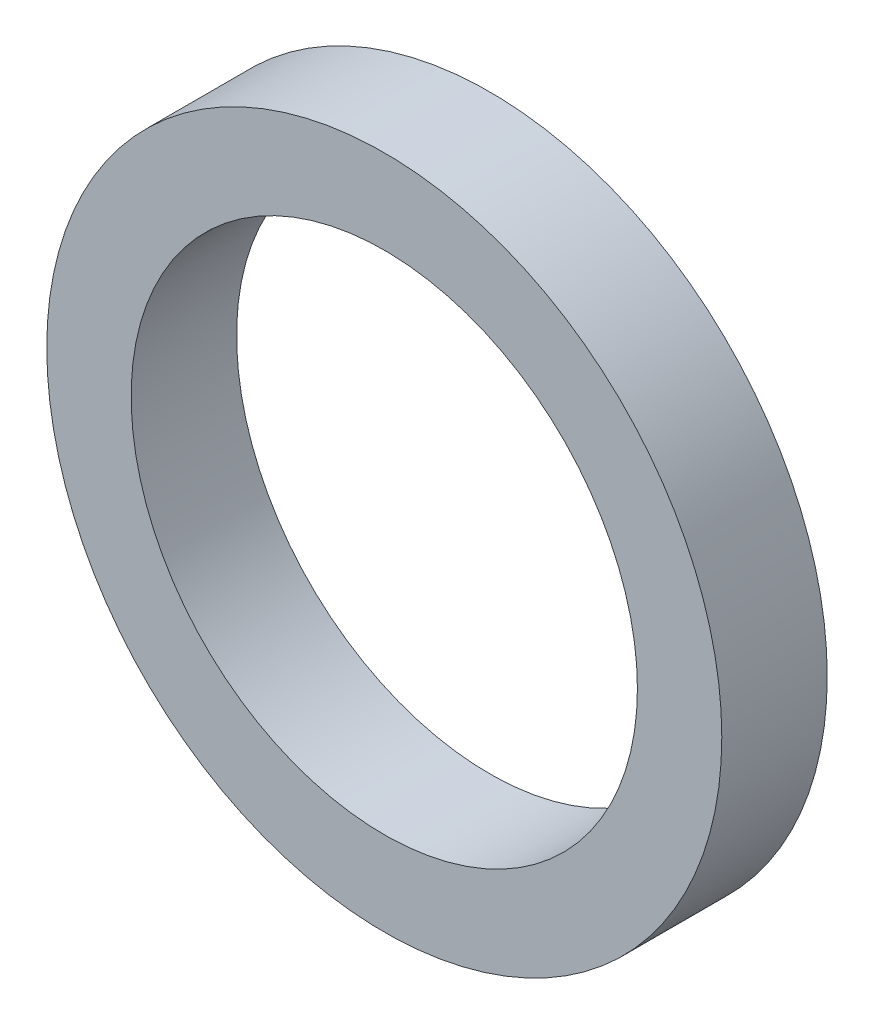
ISO-10303-21;
HEADER;
FILE_DESCRIPTION(('STEP AP214'),'2;1');
FILE_NAME('part.step','',(''),(''),'','','');
FILE_SCHEMA(('AUTOMOTIVE_DESIGN { 1 0 10303 214 1 1 1 1 }'));
ENDSEC;
DATA;
#1=APPLICATION_CONTEXT('core data for automotive mechanical design processes');
#2=APPLICATION_PROTOCOL_DEFINITION('international standard','automotive_design',2000,#1);
#3=PRODUCT_CONTEXT('',#1,'mechanical');
#4=PRODUCT('Part','Part','',(#3));
#5=PRODUCT_RELATED_PRODUCT_CATEGORY('part','',(#4));
#6=PRODUCT_DEFINITION_FORMATION('','',#4);
#7=PRODUCT_DEFINITION_CONTEXT('part definition',#1,'design');
#8=PRODUCT_DEFINITION('design','',#6,#7);
#9=PRODUCT_DEFINITION_SHAPE('','',#8);
#10=(LENGTH_UNIT() NAMED_UNIT(*) SI_UNIT(.MILLI.,.METRE.));
#11=(NAMED_UNIT(*) PLANE_ANGLE_UNIT() SI_UNIT($,.RADIAN.));
#12=(NAMED_UNIT(*) SI_UNIT($,.STERADIAN.) SOLID_ANGLE_UNIT());
#13=UNCERTAINTY_MEASURE_WITH_UNIT(LENGTH_MEASURE(1.E-05),#10,'distance_accuracy_value','');
#14=(GEOMETRIC_REPRESENTATION_CONTEXT(3) GLOBAL_UNCERTAINTY_ASSIGNED_CONTEXT((#13)) GLOBAL_UNIT_ASSIGNED_CONTEXT((#10,
#11,#12)) REPRESENTATION_CONTEXT('',''));
#15=CARTESIAN_POINT('',(0.,0.,0.));
#16=DIRECTION('',(0.,0.,1.));
#17=DIRECTION('',(1.,0.,0.));
#18=AXIS2_PLACEMENT_3D('',#15,#16,#17);
#19=CARTESIAN_POINT('',(0.,0.,3.96748));
#20=DIRECTION('',(0.,0.,1.));
#21=DIRECTION('',(1.,0.,0.));
#22=AXIS2_PLACEMENT_3D('',#19,#20,#21);
#23=PLANE('',#22);
#24=CARTESIAN_POINT('',(0.,0.,3.96748));
#25=DIRECTION('',(0.,0.,1.));
#26=DIRECTION('',(1.,0.,0.));
#27=AXIS2_PLACEMENT_3D('',#24,#25,#26);
#28=CIRCLE('',#27,12.7);
#29=CARTESIAN_POINT('',(12.7,0.,3.96748));
#30=VERTEX_POINT('',#29);
#31=EDGE_CURVE('E10',#30,#30,#28,.T.);
#32=ORIENTED_EDGE('',*,*,#31,.T.);
#33=EDGE_LOOP('',(#32));
#34=FACE_BOUND('',#33,.T.);
#35=CARTESIAN_POINT('',(0.,0.,3.96748));
#36=DIRECTION('',(0.,0.,1.));
#37=DIRECTION('',(1.,0.,0.));
#38=AXIS2_PLACEMENT_3D('',#35,#36,#37);
#39=CIRCLE('',#38,9.525);
#40=CARTESIAN_POINT('',(9.525,0.,3.96748));
#41=VERTEX_POINT('',#40);
#42=EDGE_CURVE('E42',#41,#41,#39,.T.);
#43=ORIENTED_EDGE('',*,*,#42,.F.);
#44=EDGE_LOOP('',(#43));
#45=FACE_BOUND('',#44,.T.);
#46=ADVANCED_FACE('F31',(#34,#45),#23,.T.);
#47=CARTESIAN_POINT('',(0.,0.,0.));
#48=DIRECTION('',(0.,0.,1.));
#49=DIRECTION('',(1.,0.,0.));
#50=AXIS2_PLACEMENT_3D('',#47,#48,#49);
#51=PLANE('',#50);
#52=CARTESIAN_POINT('',(0.,0.,0.));
#53=DIRECTION('',(0.,0.,1.));
#54=DIRECTION('',(1.,0.,0.));
#55=AXIS2_PLACEMENT_3D('',#52,#53,#54);
#56=CIRCLE('',#55,12.7);
#57=CARTESIAN_POINT('',(12.7,0.,0.));
#58=VERTEX_POINT('',#57);
#59=EDGE_CURVE('E35',#58,#58,#56,.T.);
#60=ORIENTED_EDGE('',*,*,#59,.F.);
#61=EDGE_LOOP('',(#60));
#62=FACE_BOUND('',#61,.T.);
#63=CARTESIAN_POINT('',(0.,0.,0.));
#64=DIRECTION('',(0.,0.,1.));
#65=DIRECTION('',(1.,0.,0.));
#66=AXIS2_PLACEMENT_3D('',#63,#64,#65);
#67=CIRCLE('',#66,9.525);
#68=CARTESIAN_POINT('',(9.525,0.,0.));
#69=VERTEX_POINT('',#68);
#70=EDGE_CURVE('E44',#69,#69,#67,.T.);
#71=ORIENTED_EDGE('',*,*,#70,.T.);
#72=EDGE_LOOP('',(#71));
#73=FACE_BOUND('',#72,.T.);
#74=ADVANCED_FACE('F54',(#62,#73),#51,.F.);
#75=CARTESIAN_POINT('',(0.,0.,3.96748));
#76=DIRECTION('',(0.,0.,-1.));
#77=DIRECTION('',(-1.,0.,0.));
#78=AXIS2_PLACEMENT_3D('',#75,#76,#77);
#79=CYLINDRICAL_SURFACE('',#78,12.7);
#80=ORIENTED_EDGE('',*,*,#31,.F.);
#81=EDGE_LOOP('',(#80));
#82=FACE_BOUND('',#81,.T.);
#83=ORIENTED_EDGE('',*,*,#59,.T.);
#84=EDGE_LOOP('',(#83));
#85=FACE_BOUND('',#84,.T.);
#86=ADVANCED_FACE('F33',(#82,#85),#79,.T.);
#87=CARTESIAN_POINT('',(0.,0.,3.96748));
#88=DIRECTION('',(0.,0.,-1.));
#89=DIRECTION('',(-1.,0.,0.));
#90=AXIS2_PLACEMENT_3D('',#87,#88,#89);
#91=CYLINDRICAL_SURFACE('',#90,9.525);
#92=ORIENTED_EDGE('',*,*,#42,.T.);
#93=EDGE_LOOP('',(#92));
#94=FACE_BOUND('',#93,.T.);
#95=ORIENTED_EDGE('',*,*,#70,.F.);
#96=EDGE_LOOP('',(#95));
#97=FACE_BOUND('',#96,.T.);
#98=ADVANCED_FACE('F50',(#94,#97),#91,.F.);
#99=CLOSED_SHELL('',(#46,#74,#86,#98));
#100=MANIFOLD_SOLID_BREP('B2',#99);
#101=ADVANCED_BREP_SHAPE_REPRESENTATION('',(#18,#100),#14);
#102=SHAPE_DEFINITION_REPRESENTATION(#9,#101);
ENDSEC;
END-ISO-10303-21;
